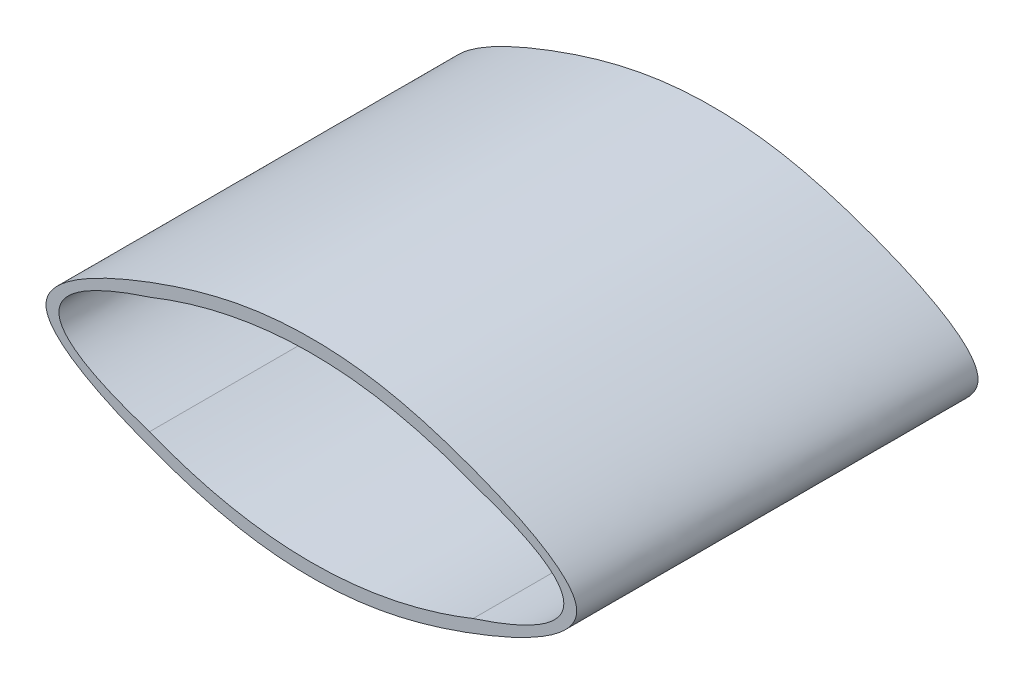
ISO-10303-21;
HEADER;
FILE_DESCRIPTION(('STEP AP214'),'2;1');
FILE_NAME('part.step','',(''),(''),'','','');
FILE_SCHEMA(('AUTOMOTIVE_DESIGN { 1 0 10303 214 1 1 1 1 }'));
ENDSEC;
DATA;
#1=APPLICATION_CONTEXT('core data for automotive mechanical design processes');
#2=APPLICATION_PROTOCOL_DEFINITION('international standard','automotive_design',2000,#1);
#3=PRODUCT_CONTEXT('',#1,'mechanical');
#4=PRODUCT('Part','Part','',(#3));
#5=PRODUCT_RELATED_PRODUCT_CATEGORY('part','',(#4));
#6=PRODUCT_DEFINITION_FORMATION('','',#4);
#7=PRODUCT_DEFINITION_CONTEXT('part definition',#1,'design');
#8=PRODUCT_DEFINITION('design','',#6,#7);
#9=PRODUCT_DEFINITION_SHAPE('','',#8);
#10=(LENGTH_UNIT() NAMED_UNIT(*) SI_UNIT(.MILLI.,.METRE.));
#11=(NAMED_UNIT(*) PLANE_ANGLE_UNIT() SI_UNIT($,.RADIAN.));
#12=(NAMED_UNIT(*) SI_UNIT($,.STERADIAN.) SOLID_ANGLE_UNIT());
#13=UNCERTAINTY_MEASURE_WITH_UNIT(LENGTH_MEASURE(1.E-05),#10,'distance_accuracy_value','');
#14=(GEOMETRIC_REPRESENTATION_CONTEXT(3) GLOBAL_UNCERTAINTY_ASSIGNED_CONTEXT((#13)) GLOBAL_UNIT_ASSIGNED_CONTEXT((#10,
#11,#12)) REPRESENTATION_CONTEXT('',''));
#15=CARTESIAN_POINT('',(0.,0.,0.));
#16=DIRECTION('',(0.,0.,1.));
#17=DIRECTION('',(1.,0.,0.));
#18=AXIS2_PLACEMENT_3D('',#15,#16,#17);
#19=CARTESIAN_POINT('',(0.,11.5,31.));
#20=CARTESIAN_POINT('',(12.5,16.5,31.));
#21=CARTESIAN_POINT('',(25.,11.5,31.));
#22=B_SPLINE_CURVE_WITH_KNOTS('',2,(#19,#20,#21),.UNSPECIFIED.,.F.,.F.,(3,3),(0.,1.),.UNSPECIFIED.);
#23=DIRECTION('',(0.,0.,-1.));
#24=VECTOR('',#23,1.);
#25=SURFACE_OF_LINEAR_EXTRUSION('',#22,#24);
#26=DIRECTION('',(0.,0.,-1.));
#27=VECTOR('',#26,1.);
#28=CARTESIAN_POINT('',(15.9989178891743,13.8041211776771,31.));
#29=LINE('',#28,#27);
#30=CARTESIAN_POINT('',(15.9989178891743,13.8041211776771,1.));
#31=VERTEX_POINT('',#30);
#32=CARTESIAN_POINT('',(15.9989178891743,13.8041211776771,0.));
#33=VERTEX_POINT('',#32);
#34=EDGE_CURVE('E67',#31,#33,#29,.T.);
#35=ORIENTED_EDGE('',*,*,#34,.F.);
#36=CARTESIAN_POINT('',(0.,11.5,1.));
#37=CARTESIAN_POINT('',(12.5,16.5,1.));
#38=CARTESIAN_POINT('',(25.,11.5,1.));
#39=B_SPLINE_CURVE_WITH_KNOTS('',2,(#36,#37,#38),.UNSPECIFIED.,.F.,.F.,(3,3),(0.,1.),.UNSPECIFIED.);
#40=CARTESIAN_POINT('',(17.9989178891743,13.5161904327699,1.));
#41=VERTEX_POINT('',#40);
#42=EDGE_CURVE('E217',#41,#31,#39,.F.);
#43=ORIENTED_EDGE('',*,*,#42,.F.);
#44=DIRECTION('',(0.,0.,-1.));
#45=VECTOR('',#44,1.);
#46=CARTESIAN_POINT('',(17.9989178891743,13.5161904327699,31.));
#47=LINE('',#46,#45);
#48=CARTESIAN_POINT('',(17.9989178891743,13.5161904327699,0.));
#49=VERTEX_POINT('',#48);
#50=EDGE_CURVE('E208',#41,#49,#47,.T.);
#51=ORIENTED_EDGE('',*,*,#50,.T.);
#52=CARTESIAN_POINT('',(0.,11.5,0.));
#53=CARTESIAN_POINT('',(12.5,16.5,0.));
#54=CARTESIAN_POINT('',(25.,11.5,0.));
#55=B_SPLINE_CURVE_WITH_KNOTS('',2,(#52,#53,#54),.UNSPECIFIED.,.F.,.F.,(3,3),(0.,1.),.UNSPECIFIED.);
#56=CARTESIAN_POINT('',(25.,11.5,0.));
#57=VERTEX_POINT('',#56);
#58=EDGE_CURVE('E304',#49,#57,#55,.T.);
#59=ORIENTED_EDGE('',*,*,#58,.T.);
#60=DIRECTION('',(0.,0.,-1.));
#61=VECTOR('',#60,1.);
#62=CARTESIAN_POINT('',(25.,11.5,31.));
#63=LINE('',#62,#61);
#64=CARTESIAN_POINT('',(25.,11.5,31.));
#65=VERTEX_POINT('',#64);
#66=EDGE_CURVE('E278',#65,#57,#63,.T.);
#67=ORIENTED_EDGE('',*,*,#66,.F.);
#68=CARTESIAN_POINT('',(0.,11.5,31.));
#69=VERTEX_POINT('',#68);
#70=EDGE_CURVE('E263',#69,#65,#22,.T.);
#71=ORIENTED_EDGE('',*,*,#70,.F.);
#72=DIRECTION('',(0.,0.,-1.));
#73=VECTOR('',#72,1.);
#74=CARTESIAN_POINT('',(0.,11.5,31.));
#75=LINE('',#74,#73);
#76=CARTESIAN_POINT('',(0.,11.5,0.));
#77=VERTEX_POINT('',#76);
#78=EDGE_CURVE('E327',#69,#77,#75,.T.);
#79=ORIENTED_EDGE('',*,*,#78,.T.);
#80=EDGE_CURVE('E305',#77,#33,#55,.T.);
#81=ORIENTED_EDGE('',*,*,#80,.T.);
#82=EDGE_LOOP('',(#35,#43,#51,#59,#67,#71,#79,#81));
#83=FACE_BOUND('',#82,.T.);
#84=ADVANCED_FACE('F42',(#83),#25,.F.);
#85=CARTESIAN_POINT('',(25.,11.5,31.));
#86=CARTESIAN_POINT('',(39.,7.,31.));
#87=CARTESIAN_POINT('',(25.,2.5,31.));
#88=B_SPLINE_CURVE_WITH_KNOTS('',2,(#85,#86,#87),.UNSPECIFIED.,.F.,.F.,(3,3),(0.,1.),.UNSPECIFIED.);
#89=DIRECTION('',(0.,0.,-1.));
#90=VECTOR('',#89,1.);
#91=SURFACE_OF_LINEAR_EXTRUSION('',#88,#90);
#92=CARTESIAN_POINT('',(25.,11.5,0.));
#93=CARTESIAN_POINT('',(39.,7.,0.));
#94=CARTESIAN_POINT('',(25.,2.5,0.));
#95=B_SPLINE_CURVE_WITH_KNOTS('',2,(#92,#93,#94),.UNSPECIFIED.,.F.,.F.,(3,3),(0.,1.),.UNSPECIFIED.);
#96=CARTESIAN_POINT('',(25.,2.5,0.));
#97=VERTEX_POINT('',#96);
#98=EDGE_CURVE('E221',#57,#97,#95,.T.);
#99=ORIENTED_EDGE('',*,*,#98,.T.);
#100=DIRECTION('',(0.,0.,-1.));
#101=VECTOR('',#100,1.);
#102=CARTESIAN_POINT('',(25.,2.5,31.));
#103=LINE('',#102,#101);
#104=CARTESIAN_POINT('',(25.,2.5,31.));
#105=VERTEX_POINT('',#104);
#106=EDGE_CURVE('E12',#105,#97,#103,.T.);
#107=ORIENTED_EDGE('',*,*,#106,.F.);
#108=EDGE_CURVE('E222',#65,#105,#88,.T.);
#109=ORIENTED_EDGE('',*,*,#108,.F.);
#110=ORIENTED_EDGE('',*,*,#66,.T.);
#111=EDGE_LOOP('',(#99,#107,#109,#110));
#112=FACE_BOUND('',#111,.T.);
#113=ADVANCED_FACE('F44',(#112),#91,.F.);
#114=CARTESIAN_POINT('',(0.,2.5,31.));
#115=CARTESIAN_POINT('',(12.5,-2.5,31.));
#116=CARTESIAN_POINT('',(25.,2.5,31.));
#117=B_SPLINE_CURVE_WITH_KNOTS('',2,(#114,#115,#116),.UNSPECIFIED.,.F.,.F.,(3,3),(0.,1.),.UNSPECIFIED.);
#118=DIRECTION('',(0.,0.,-1.));
#119=VECTOR('',#118,1.);
#120=SURFACE_OF_LINEAR_EXTRUSION('',#117,#119);
#121=DIRECTION('',(0.,0.,-1.));
#122=VECTOR('',#121,1.);
#123=CARTESIAN_POINT('',(7.00108211082573,0.483809567230092,31.));
#124=LINE('',#123,#122);
#125=CARTESIAN_POINT('',(7.00108211082573,0.483809567230093,0.));
#126=VERTEX_POINT('',#125);
#127=CARTESIAN_POINT('',(7.00108211082573,0.483809567230093,1.));
#128=VERTEX_POINT('',#127);
#129=EDGE_CURVE('E171',#126,#128,#124,.F.);
#130=ORIENTED_EDGE('',*,*,#129,.F.);
#131=CARTESIAN_POINT('',(0.,2.5,0.));
#132=CARTESIAN_POINT('',(12.5,-2.5,0.));
#133=CARTESIAN_POINT('',(25.,2.5,0.));
#134=B_SPLINE_CURVE_WITH_KNOTS('',2,(#131,#132,#133),.UNSPECIFIED.,.F.,.F.,(3,3),(0.,1.),.UNSPECIFIED.);
#135=CARTESIAN_POINT('',(0.,2.5,0.));
#136=VERTEX_POINT('',#135);
#137=EDGE_CURVE('E288',#136,#126,#134,.T.);
#138=ORIENTED_EDGE('',*,*,#137,.F.);
#139=DIRECTION('',(0.,0.,-1.));
#140=VECTOR('',#139,1.);
#141=CARTESIAN_POINT('',(0.,2.5,31.));
#142=LINE('',#141,#140);
#143=CARTESIAN_POINT('',(0.,2.5,31.));
#144=VERTEX_POINT('',#143);
#145=EDGE_CURVE('E52',#144,#136,#142,.T.);
#146=ORIENTED_EDGE('',*,*,#145,.F.);
#147=EDGE_CURVE('E231',#144,#105,#117,.T.);
#148=ORIENTED_EDGE('',*,*,#147,.T.);
#149=ORIENTED_EDGE('',*,*,#106,.T.);
#150=CARTESIAN_POINT('',(9.00108211082573,0.195878822322939,0.));
#151=VERTEX_POINT('',#150);
#152=EDGE_CURVE('E287',#151,#97,#134,.T.);
#153=ORIENTED_EDGE('',*,*,#152,.F.);
#154=DIRECTION('',(0.,0.,-1.));
#155=VECTOR('',#154,1.);
#156=CARTESIAN_POINT('',(9.00108211082573,0.195878822322939,31.));
#157=LINE('',#156,#155);
#158=CARTESIAN_POINT('',(9.00108211082573,0.195878822322939,1.));
#159=VERTEX_POINT('',#158);
#160=EDGE_CURVE('E138',#151,#159,#157,.F.);
#161=ORIENTED_EDGE('',*,*,#160,.T.);
#162=CARTESIAN_POINT('',(0.,2.5,1.));
#163=CARTESIAN_POINT('',(12.5,-2.5,1.));
#164=CARTESIAN_POINT('',(25.,2.5,1.));
#165=B_SPLINE_CURVE_WITH_KNOTS('',2,(#162,#163,#164),.UNSPECIFIED.,.F.,.F.,(3,3),(0.,1.),.UNSPECIFIED.);
#166=EDGE_CURVE('E174',#159,#128,#165,.F.);
#167=ORIENTED_EDGE('',*,*,#166,.T.);
#168=EDGE_LOOP('',(#130,#138,#146,#148,#149,#153,#161,#167));
#169=FACE_BOUND('',#168,.T.);
#170=ADVANCED_FACE('F250',(#169),#120,.T.);
#171=CARTESIAN_POINT('',(0.,2.5,31.));
#172=CARTESIAN_POINT('',(-14.,7.,31.));
#173=CARTESIAN_POINT('',(0.,11.5,31.));
#174=B_SPLINE_CURVE_WITH_KNOTS('',2,(#171,#172,#173),.UNSPECIFIED.,.F.,.F.,(3,3),(0.,1.),.UNSPECIFIED.);
#175=DIRECTION('',(0.,0.,-1.));
#176=VECTOR('',#175,1.);
#177=SURFACE_OF_LINEAR_EXTRUSION('',#174,#176);
#178=CARTESIAN_POINT('',(0.,2.5,0.));
#179=CARTESIAN_POINT('',(-14.,7.,0.));
#180=CARTESIAN_POINT('',(0.,11.5,0.));
#181=B_SPLINE_CURVE_WITH_KNOTS('',2,(#178,#179,#180),.UNSPECIFIED.,.F.,.F.,(3,3),(0.,1.),.UNSPECIFIED.);
#182=EDGE_CURVE('E296',#136,#77,#181,.T.);
#183=ORIENTED_EDGE('',*,*,#182,.T.);
#184=ORIENTED_EDGE('',*,*,#78,.F.);
#185=EDGE_CURVE('E242',#144,#69,#174,.T.);
#186=ORIENTED_EDGE('',*,*,#185,.F.);
#187=ORIENTED_EDGE('',*,*,#145,.T.);
#188=EDGE_LOOP('',(#183,#184,#186,#187));
#189=FACE_BOUND('',#188,.T.);
#190=ADVANCED_FACE('F253',(#189),#177,.F.);
#191=CARTESIAN_POINT('',(-8.,7.,31.));
#192=CARTESIAN_POINT('',(-8.,9.05536136481655,31.));
#193=CARTESIAN_POINT('',(1.94746776920997,13.8095444201506,31.));
#194=CARTESIAN_POINT('',(12.5,15.6757895737503,31.));
#195=CARTESIAN_POINT('',(23.05253223079,13.8095444201506,31.));
#196=CARTESIAN_POINT('',(37.3005582016142,7.,31.));
#197=CARTESIAN_POINT('',(23.05253223079,0.190455579849382,31.));
#198=CARTESIAN_POINT('',(12.5,-1.6757895737503,31.));
#199=CARTESIAN_POINT('',(1.94746776920997,0.190455579849378,31.));
#200=CARTESIAN_POINT('',(-7.99999999999999,4.94463863518345,31.));
#201=CARTESIAN_POINT('',(-8.,7.,31.));
#202=B_SPLINE_CURVE_WITH_KNOTS('',3,(#191,#192,#193,#194,#195,#196,#197,#198,#199,#200,#201),
.UNSPECIFIED.,.T.,.F.,(4,1,1,1,1,1,1,1,4),(0.,0.108081732491899,0.25,0.391918267508101,0.5,
0.608081732491899,0.75,0.891918267508101,1.),.UNSPECIFIED.);
#203=DIRECTION('',(0.,0.,-1.));
#204=VECTOR('',#203,1.);
#205=SURFACE_OF_LINEAR_EXTRUSION('',#202,#204);
#206=CARTESIAN_POINT('',(-8.,7.,0.));
#207=CARTESIAN_POINT('',(-8.,9.05536136481655,0.));
#208=CARTESIAN_POINT('',(1.94746776920997,13.8095444201506,0.));
#209=CARTESIAN_POINT('',(12.5,15.6757895737503,0.));
#210=CARTESIAN_POINT('',(23.05253223079,13.8095444201506,0.));
#211=CARTESIAN_POINT('',(37.3005582016142,7.,0.));
#212=CARTESIAN_POINT('',(23.05253223079,0.190455579849382,0.));
#213=CARTESIAN_POINT('',(12.5,-1.6757895737503,0.));
#214=CARTESIAN_POINT('',(1.94746776920997,0.190455579849378,0.));
#215=CARTESIAN_POINT('',(-7.99999999999999,4.94463863518345,0.));
#216=CARTESIAN_POINT('',(-8.,7.,0.));
#217=B_SPLINE_CURVE_WITH_KNOTS('',3,(#206,#207,#208,#209,#210,#211,#212,#213,#214,#215,#216),
.UNSPECIFIED.,.T.,.F.,(4,1,1,1,1,1,1,1,4),(0.,0.108081732491899,0.25,0.391918267508101,0.5,
0.608081732491899,0.75,0.891918267508101,1.),.UNSPECIFIED.);
#218=CARTESIAN_POINT('',(-8.,7.,0.));
#219=VERTEX_POINT('',#218);
#220=EDGE_CURVE('E232',#219,#219,#217,.T.);
#221=ORIENTED_EDGE('',*,*,#220,.F.);
#222=EDGE_LOOP('',(#221));
#223=FACE_BOUND('',#222,.T.);
#224=CARTESIAN_POINT('',(-8.,7.,31.));
#225=VERTEX_POINT('',#224);
#226=EDGE_CURVE('E268',#225,#225,#202,.T.);
#227=ORIENTED_EDGE('',*,*,#226,.T.);
#228=EDGE_LOOP('',(#227));
#229=FACE_BOUND('',#228,.T.);
#230=ADVANCED_FACE('F257',(#223,#229),#205,.T.);
#231=CARTESIAN_POINT('',(0.,0.,31.));
#232=DIRECTION('',(0.,0.,1.));
#233=DIRECTION('',(1.,0.,0.));
#234=AXIS2_PLACEMENT_3D('',#231,#232,#233);
#235=PLANE('',#234);
#236=ORIENTED_EDGE('',*,*,#108,.T.);
#237=ORIENTED_EDGE('',*,*,#147,.F.);
#238=ORIENTED_EDGE('',*,*,#185,.T.);
#239=ORIENTED_EDGE('',*,*,#70,.T.);
#240=EDGE_LOOP('',(#236,#237,#238,#239));
#241=FACE_BOUND('',#240,.T.);
#242=ORIENTED_EDGE('',*,*,#226,.F.);
#243=EDGE_LOOP('',(#242));
#244=FACE_BOUND('',#243,.T.);
#245=ADVANCED_FACE('F352',(#241,#244),#235,.T.);
#246=CARTESIAN_POINT('',(0.,0.,0.));
#247=DIRECTION('',(0.,0.,1.));
#248=DIRECTION('',(1.,0.,0.));
#249=AXIS2_PLACEMENT_3D('',#246,#247,#248);
#250=PLANE('',#249);
#251=ORIENTED_EDGE('',*,*,#220,.T.);
#252=EDGE_LOOP('',(#251));
#253=FACE_BOUND('',#252,.T.);
#254=ORIENTED_EDGE('',*,*,#137,.T.);
#255=DIRECTION('',(0.,1.,0.));
#256=VECTOR('',#255,1.);
#257=CARTESIAN_POINT('',(7.00108211082573,0.,0.));
#258=LINE('',#257,#256);
#259=CARTESIAN_POINT('',(7.00108211082573,9.19888753732348,0.));
#260=VERTEX_POINT('',#259);
#261=EDGE_CURVE('E155',#126,#260,#258,.T.);
#262=ORIENTED_EDGE('',*,*,#261,.T.);
#263=DIRECTION('',(-1.,0.,0.));
#264=VECTOR('',#263,1.);
#265=CARTESIAN_POINT('',(0.,9.19888753732348,0.));
#266=LINE('',#265,#264);
#267=CARTESIAN_POINT('',(9.00108211082573,9.19888753732348,0.));
#268=VERTEX_POINT('',#267);
#269=EDGE_CURVE('E141',#268,#260,#266,.T.);
#270=ORIENTED_EDGE('',*,*,#269,.F.);
#271=DIRECTION('',(0.,1.,0.));
#272=VECTOR('',#271,1.);
#273=CARTESIAN_POINT('',(9.00108211082573,0.,0.));
#274=LINE('',#273,#272);
#275=EDGE_CURVE('E59',#151,#268,#274,.T.);
#276=ORIENTED_EDGE('',*,*,#275,.F.);
#277=ORIENTED_EDGE('',*,*,#152,.T.);
#278=ORIENTED_EDGE('',*,*,#98,.F.);
#279=ORIENTED_EDGE('',*,*,#58,.F.);
#280=DIRECTION('',(0.,-1.,0.));
#281=VECTOR('',#280,1.);
#282=CARTESIAN_POINT('',(17.9989178891743,0.,0.));
#283=LINE('',#282,#281);
#284=CARTESIAN_POINT('',(17.9989178891743,4.50245830124171,0.));
#285=VERTEX_POINT('',#284);
#286=EDGE_CURVE('E180',#49,#285,#283,.T.);
#287=ORIENTED_EDGE('',*,*,#286,.T.);
#288=DIRECTION('',(-1.,0.,0.));
#289=VECTOR('',#288,1.);
#290=CARTESIAN_POINT('',(0.,4.50245830124171,0.));
#291=LINE('',#290,#289);
#292=CARTESIAN_POINT('',(15.9989178891743,4.50245830124171,0.));
#293=VERTEX_POINT('',#292);
#294=EDGE_CURVE('E198',#285,#293,#291,.T.);
#295=ORIENTED_EDGE('',*,*,#294,.T.);
#296=DIRECTION('',(0.,-1.,0.));
#297=VECTOR('',#296,1.);
#298=CARTESIAN_POINT('',(15.9989178891743,0.,0.));
#299=LINE('',#298,#297);
#300=EDGE_CURVE('E188',#33,#293,#299,.T.);
#301=ORIENTED_EDGE('',*,*,#300,.F.);
#302=ORIENTED_EDGE('',*,*,#80,.F.);
#303=ORIENTED_EDGE('',*,*,#182,.F.);
#304=EDGE_LOOP('',(#254,#262,#270,#276,#277,#278,#279,#287,#295,#301,#302,#303));
#305=FACE_BOUND('',#304,.T.);
#306=ADVANCED_FACE('F154',(#253,#305),#250,.F.);
#307=CARTESIAN_POINT('',(0.,0.,1.));
#308=DIRECTION('',(0.,0.,-1.));
#309=DIRECTION('',(-1.,0.,0.));
#310=AXIS2_PLACEMENT_3D('',#307,#308,#309);
#311=PLANE('',#310);
#312=DIRECTION('',(0.,-1.,0.));
#313=VECTOR('',#312,1.);
#314=CARTESIAN_POINT('',(17.9989178891743,0.,1.));
#315=LINE('',#314,#313);
#316=CARTESIAN_POINT('',(17.9989178891743,4.50245830124171,1.));
#317=VERTEX_POINT('',#316);
#318=EDGE_CURVE('E181',#41,#317,#315,.T.);
#319=ORIENTED_EDGE('',*,*,#318,.F.);
#320=ORIENTED_EDGE('',*,*,#42,.T.);
#321=DIRECTION('',(0.,-1.,0.));
#322=VECTOR('',#321,1.);
#323=CARTESIAN_POINT('',(15.9989178891743,0.,1.));
#324=LINE('',#323,#322);
#325=CARTESIAN_POINT('',(15.9989178891743,4.50245830124171,1.));
#326=VERTEX_POINT('',#325);
#327=EDGE_CURVE('E192',#31,#326,#324,.T.);
#328=ORIENTED_EDGE('',*,*,#327,.T.);
#329=DIRECTION('',(-1.,0.,0.));
#330=VECTOR('',#329,1.);
#331=CARTESIAN_POINT('',(0.,4.50245830124171,1.));
#332=LINE('',#331,#330);
#333=EDGE_CURVE('E187',#317,#326,#332,.T.);
#334=ORIENTED_EDGE('',*,*,#333,.F.);
#335=EDGE_LOOP('',(#319,#320,#328,#334));
#336=FACE_BOUND('',#335,.T.);
#337=ADVANCED_FACE('F373',(#336),#311,.F.);
#338=CARTESIAN_POINT('',(15.9989178891743,0.,1.));
#339=DIRECTION('',(1.,0.,0.));
#340=DIRECTION('',(0.,1.,0.));
#341=AXIS2_PLACEMENT_3D('',#338,#339,#340);
#342=PLANE('',#341);
#343=ORIENTED_EDGE('',*,*,#327,.F.);
#344=ORIENTED_EDGE('',*,*,#34,.T.);
#345=ORIENTED_EDGE('',*,*,#300,.T.);
#346=DIRECTION('',(0.,0.,-1.));
#347=VECTOR('',#346,1.);
#348=CARTESIAN_POINT('',(15.9989178891743,4.50245830124171,1.));
#349=LINE('',#348,#347);
#350=EDGE_CURVE('E204',#326,#293,#349,.T.);
#351=ORIENTED_EDGE('',*,*,#350,.F.);
#352=EDGE_LOOP('',(#343,#344,#345,#351));
#353=FACE_BOUND('',#352,.T.);
#354=ADVANCED_FACE('F371',(#353),#342,.F.);
#355=CARTESIAN_POINT('',(17.9989178891743,0.,1.));
#356=DIRECTION('',(1.,0.,0.));
#357=DIRECTION('',(0.,0.,-1.));
#358=AXIS2_PLACEMENT_3D('',#355,#356,#357);
#359=PLANE('',#358);
#360=ORIENTED_EDGE('',*,*,#50,.F.);
#361=ORIENTED_EDGE('',*,*,#318,.T.);
#362=DIRECTION('',(0.,0.,-1.));
#363=VECTOR('',#362,1.);
#364=CARTESIAN_POINT('',(17.9989178891743,4.50245830124171,1.));
#365=LINE('',#364,#363);
#366=EDGE_CURVE('E195',#317,#285,#365,.T.);
#367=ORIENTED_EDGE('',*,*,#366,.T.);
#368=ORIENTED_EDGE('',*,*,#286,.F.);
#369=EDGE_LOOP('',(#360,#361,#367,#368));
#370=FACE_BOUND('',#369,.T.);
#371=ADVANCED_FACE('F362',(#370),#359,.T.);
#372=CARTESIAN_POINT('',(0.,4.50245830124171,1.));
#373=DIRECTION('',(0.,-1.,0.));
#374=DIRECTION('',(0.,0.,-1.));
#375=AXIS2_PLACEMENT_3D('',#372,#373,#374);
#376=PLANE('',#375);
#377=ORIENTED_EDGE('',*,*,#294,.F.);
#378=ORIENTED_EDGE('',*,*,#366,.F.);
#379=ORIENTED_EDGE('',*,*,#333,.T.);
#380=ORIENTED_EDGE('',*,*,#350,.T.);
#381=EDGE_LOOP('',(#377,#378,#379,#380));
#382=FACE_BOUND('',#381,.T.);
#383=ADVANCED_FACE('F367',(#382),#376,.T.);
#384=CARTESIAN_POINT('',(7.00108211082573,0.,1.));
#385=DIRECTION('',(-1.,0.,0.));
#386=DIRECTION('',(0.,0.,1.));
#387=AXIS2_PLACEMENT_3D('',#384,#385,#386);
#388=PLANE('',#387);
#389=ORIENTED_EDGE('',*,*,#261,.F.);
#390=ORIENTED_EDGE('',*,*,#129,.T.);
#391=DIRECTION('',(0.,1.,0.));
#392=VECTOR('',#391,1.);
#393=CARTESIAN_POINT('',(7.00108211082573,0.,1.));
#394=LINE('',#393,#392);
#395=CARTESIAN_POINT('',(7.00108211082573,9.19888753732348,1.));
#396=VERTEX_POINT('',#395);
#397=EDGE_CURVE('E142',#128,#396,#394,.T.);
#398=ORIENTED_EDGE('',*,*,#397,.T.);
#399=DIRECTION('',(0.,0.,-1.));
#400=VECTOR('',#399,1.);
#401=CARTESIAN_POINT('',(7.00108211082573,9.19888753732348,1.));
#402=LINE('',#401,#400);
#403=EDGE_CURVE('E151',#396,#260,#402,.T.);
#404=ORIENTED_EDGE('',*,*,#403,.T.);
#405=EDGE_LOOP('',(#389,#390,#398,#404));
#406=FACE_BOUND('',#405,.T.);
#407=ADVANCED_FACE('F341',(#406),#388,.T.);
#408=CARTESIAN_POINT('',(9.00108211082573,0.,1.));
#409=DIRECTION('',(-1.,0.,0.));
#410=DIRECTION('',(0.,0.,1.));
#411=AXIS2_PLACEMENT_3D('',#408,#409,#410);
#412=PLANE('',#411);
#413=ORIENTED_EDGE('',*,*,#160,.F.);
#414=ORIENTED_EDGE('',*,*,#275,.T.);
#415=DIRECTION('',(0.,0.,-1.));
#416=VECTOR('',#415,1.);
#417=CARTESIAN_POINT('',(9.00108211082573,9.19888753732348,1.));
#418=LINE('',#417,#416);
#419=CARTESIAN_POINT('',(9.00108211082573,9.19888753732348,1.));
#420=VERTEX_POINT('',#419);
#421=EDGE_CURVE('E135',#420,#268,#418,.T.);
#422=ORIENTED_EDGE('',*,*,#421,.F.);
#423=DIRECTION('',(0.,1.,0.));
#424=VECTOR('',#423,1.);
#425=CARTESIAN_POINT('',(9.00108211082573,0.,1.));
#426=LINE('',#425,#424);
#427=EDGE_CURVE('E162',#159,#420,#426,.T.);
#428=ORIENTED_EDGE('',*,*,#427,.F.);
#429=EDGE_LOOP('',(#413,#414,#422,#428));
#430=FACE_BOUND('',#429,.T.);
#431=ADVANCED_FACE('F133',(#430),#412,.F.);
#432=CARTESIAN_POINT('',(0.,9.19888753732348,1.));
#433=DIRECTION('',(0.,-1.,0.));
#434=DIRECTION('',(0.,0.,-1.));
#435=AXIS2_PLACEMENT_3D('',#432,#433,#434);
#436=PLANE('',#435);
#437=ORIENTED_EDGE('',*,*,#269,.T.);
#438=ORIENTED_EDGE('',*,*,#403,.F.);
#439=DIRECTION('',(-1.,0.,0.));
#440=VECTOR('',#439,1.);
#441=CARTESIAN_POINT('',(0.,9.19888753732348,1.));
#442=LINE('',#441,#440);
#443=EDGE_CURVE('E149',#420,#396,#442,.T.);
#444=ORIENTED_EDGE('',*,*,#443,.F.);
#445=ORIENTED_EDGE('',*,*,#421,.T.);
#446=EDGE_LOOP('',(#437,#438,#444,#445));
#447=FACE_BOUND('',#446,.T.);
#448=ADVANCED_FACE('F146',(#447),#436,.F.);
#449=CARTESIAN_POINT('',(0.,0.,1.));
#450=DIRECTION('',(0.,0.,-1.));
#451=DIRECTION('',(-1.,0.,0.));
#452=AXIS2_PLACEMENT_3D('',#449,#450,#451);
#453=PLANE('',#452);
#454=ORIENTED_EDGE('',*,*,#166,.F.);
#455=ORIENTED_EDGE('',*,*,#427,.T.);
#456=ORIENTED_EDGE('',*,*,#443,.T.);
#457=ORIENTED_EDGE('',*,*,#397,.F.);
#458=EDGE_LOOP('',(#454,#455,#456,#457));
#459=FACE_BOUND('',#458,.T.);
#460=ADVANCED_FACE('F343',(#459),#453,.F.);
#461=CLOSED_SHELL('',(#84,#113,#170,#190,#230,#245,#306,#337,#354,#371,#383,#407,#431,#448,#460));
#462=MANIFOLD_SOLID_BREP('B2',#461);
#463=ADVANCED_BREP_SHAPE_REPRESENTATION('',(#18,#462),#14);
#464=SHAPE_DEFINITION_REPRESENTATION(#9,#463);
ENDSEC;
END-ISO-10303-21;
